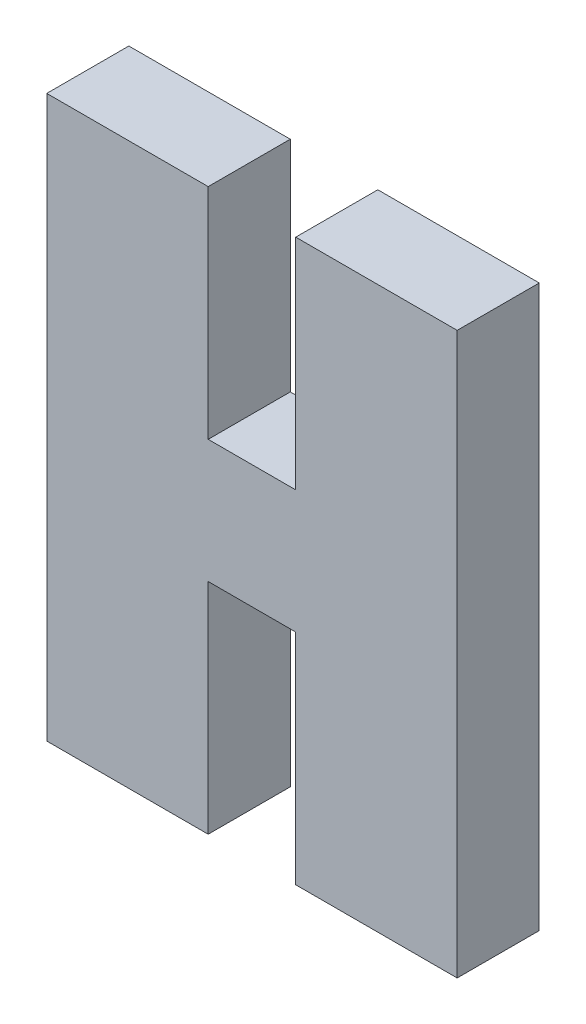
ISO-10303-21;
HEADER;
FILE_DESCRIPTION(('STEP AP214'),'2;1');
FILE_NAME('part.step','',(''),(''),'','','');
FILE_SCHEMA(('AUTOMOTIVE_DESIGN { 1 0 10303 214 1 1 1 1 }'));
ENDSEC;
DATA;
#1=APPLICATION_CONTEXT('core data for automotive mechanical design processes');
#2=APPLICATION_PROTOCOL_DEFINITION('international standard','automotive_design',2000,#1);
#3=PRODUCT_CONTEXT('',#1,'mechanical');
#4=PRODUCT('Part','Part','',(#3));
#5=PRODUCT_RELATED_PRODUCT_CATEGORY('part','',(#4));
#6=PRODUCT_DEFINITION_FORMATION('','',#4);
#7=PRODUCT_DEFINITION_CONTEXT('part definition',#1,'design');
#8=PRODUCT_DEFINITION('design','',#6,#7);
#9=PRODUCT_DEFINITION_SHAPE('','',#8);
#10=(LENGTH_UNIT() NAMED_UNIT(*) SI_UNIT(.MILLI.,.METRE.));
#11=(NAMED_UNIT(*) PLANE_ANGLE_UNIT() SI_UNIT($,.RADIAN.));
#12=(NAMED_UNIT(*) SI_UNIT($,.STERADIAN.) SOLID_ANGLE_UNIT());
#13=UNCERTAINTY_MEASURE_WITH_UNIT(LENGTH_MEASURE(1.E-05),#10,'distance_accuracy_value','');
#14=(GEOMETRIC_REPRESENTATION_CONTEXT(3) GLOBAL_UNCERTAINTY_ASSIGNED_CONTEXT((#13)) GLOBAL_UNIT_ASSIGNED_CONTEXT((#10,
#11,#12)) REPRESENTATION_CONTEXT('',''));
#15=CARTESIAN_POINT('',(0.,0.,0.));
#16=DIRECTION('',(0.,0.,1.));
#17=DIRECTION('',(1.,0.,0.));
#18=AXIS2_PLACEMENT_3D('',#15,#16,#17);
#19=CARTESIAN_POINT('',(-7.5,0.,3.));
#20=DIRECTION('',(-1.,0.,0.));
#21=DIRECTION('',(0.,0.,1.));
#22=AXIS2_PLACEMENT_3D('',#19,#20,#21);
#23=PLANE('',#22);
#24=DIRECTION('',(0.,1.,0.));
#25=VECTOR('',#24,1.);
#26=CARTESIAN_POINT('',(-7.5,0.,0.));
#27=LINE('',#26,#25);
#28=CARTESIAN_POINT('',(-7.5,-10.25,0.));
#29=VERTEX_POINT('',#28);
#30=CARTESIAN_POINT('',(-7.5,10.25,0.));
#31=VERTEX_POINT('',#30);
#32=EDGE_CURVE('E168',#29,#31,#27,.T.);
#33=ORIENTED_EDGE('',*,*,#32,.F.);
#34=DIRECTION('',(0.,0.,-1.));
#35=VECTOR('',#34,1.);
#36=CARTESIAN_POINT('',(-7.5,-10.25,3.));
#37=LINE('',#36,#35);
#38=CARTESIAN_POINT('',(-7.5,-10.25,3.));
#39=VERTEX_POINT('',#38);
#40=EDGE_CURVE('E11',#39,#29,#37,.T.);
#41=ORIENTED_EDGE('',*,*,#40,.F.);
#42=DIRECTION('',(0.,1.,0.));
#43=VECTOR('',#42,1.);
#44=CARTESIAN_POINT('',(-7.5,0.,3.));
#45=LINE('',#44,#43);
#46=CARTESIAN_POINT('',(-7.5,10.25,3.));
#47=VERTEX_POINT('',#46);
#48=EDGE_CURVE('E211',#39,#47,#45,.T.);
#49=ORIENTED_EDGE('',*,*,#48,.T.);
#50=DIRECTION('',(0.,0.,-1.));
#51=VECTOR('',#50,1.);
#52=CARTESIAN_POINT('',(-7.5,10.25,3.));
#53=LINE('',#52,#51);
#54=EDGE_CURVE('E60',#47,#31,#53,.T.);
#55=ORIENTED_EDGE('',*,*,#54,.T.);
#56=EDGE_LOOP('',(#33,#41,#49,#55));
#57=FACE_BOUND('',#56,.T.);
#58=ADVANCED_FACE('F43',(#57),#23,.T.);
#59=CARTESIAN_POINT('',(0.,-10.25,3.));
#60=DIRECTION('',(0.,1.,0.));
#61=DIRECTION('',(-1.,0.,0.));
#62=AXIS2_PLACEMENT_3D('',#59,#60,#61);
#63=PLANE('',#62);
#64=DIRECTION('',(1.,0.,0.));
#65=VECTOR('',#64,1.);
#66=CARTESIAN_POINT('',(0.,-10.25,0.));
#67=LINE('',#66,#65);
#68=CARTESIAN_POINT('',(-1.6,-10.25,0.));
#69=VERTEX_POINT('',#68);
#70=EDGE_CURVE('E171',#29,#69,#67,.T.);
#71=ORIENTED_EDGE('',*,*,#70,.T.);
#72=DIRECTION('',(0.,0.,-1.));
#73=VECTOR('',#72,1.);
#74=CARTESIAN_POINT('',(-1.6,-10.25,3.));
#75=LINE('',#74,#73);
#76=CARTESIAN_POINT('',(-1.6,-10.25,3.));
#77=VERTEX_POINT('',#76);
#78=EDGE_CURVE('E52',#77,#69,#75,.T.);
#79=ORIENTED_EDGE('',*,*,#78,.F.);
#80=DIRECTION('',(1.,0.,0.));
#81=VECTOR('',#80,1.);
#82=CARTESIAN_POINT('',(0.,-10.25,3.));
#83=LINE('',#82,#81);
#84=EDGE_CURVE('E480',#39,#77,#83,.T.);
#85=ORIENTED_EDGE('',*,*,#84,.F.);
#86=ORIENTED_EDGE('',*,*,#40,.T.);
#87=EDGE_LOOP('',(#71,#79,#85,#86));
#88=FACE_BOUND('',#87,.T.);
#89=ADVANCED_FACE('F246',(#88),#63,.F.);
#90=CARTESIAN_POINT('',(-1.6,0.,3.));
#91=DIRECTION('',(1.,0.,0.));
#92=DIRECTION('',(0.,1.,0.));
#93=AXIS2_PLACEMENT_3D('',#90,#91,#92);
#94=PLANE('',#93);
#95=DIRECTION('',(0.,-1.,0.));
#96=VECTOR('',#95,1.);
#97=CARTESIAN_POINT('',(-1.6,0.,0.));
#98=LINE('',#97,#96);
#99=CARTESIAN_POINT('',(-1.6,-2.25,0.));
#100=VERTEX_POINT('',#99);
#101=EDGE_CURVE('E175',#100,#69,#98,.T.);
#102=ORIENTED_EDGE('',*,*,#101,.F.);
#103=DIRECTION('',(0.,0.,-1.));
#104=VECTOR('',#103,1.);
#105=CARTESIAN_POINT('',(-1.6,-2.25,3.));
#106=LINE('',#105,#104);
#107=CARTESIAN_POINT('',(-1.6,-2.25,3.));
#108=VERTEX_POINT('',#107);
#109=EDGE_CURVE('E234',#108,#100,#106,.T.);
#110=ORIENTED_EDGE('',*,*,#109,.F.);
#111=DIRECTION('',(0.,-1.,0.));
#112=VECTOR('',#111,1.);
#113=CARTESIAN_POINT('',(-1.6,0.,3.));
#114=LINE('',#113,#112);
#115=EDGE_CURVE('E243',#108,#77,#114,.T.);
#116=ORIENTED_EDGE('',*,*,#115,.T.);
#117=ORIENTED_EDGE('',*,*,#78,.T.);
#118=EDGE_LOOP('',(#102,#110,#116,#117));
#119=FACE_BOUND('',#118,.T.);
#120=ADVANCED_FACE('F241',(#119),#94,.T.);
#121=CARTESIAN_POINT('',(0.,-2.25,3.));
#122=DIRECTION('',(0.,1.,0.));
#123=DIRECTION('',(-1.,0.,0.));
#124=AXIS2_PLACEMENT_3D('',#121,#122,#123);
#125=PLANE('',#124);
#126=DIRECTION('',(1.,0.,0.));
#127=VECTOR('',#126,1.);
#128=CARTESIAN_POINT('',(0.,-2.25,0.));
#129=LINE('',#128,#127);
#130=CARTESIAN_POINT('',(1.6,-2.25,0.));
#131=VERTEX_POINT('',#130);
#132=EDGE_CURVE('E179',#100,#131,#129,.T.);
#133=ORIENTED_EDGE('',*,*,#132,.T.);
#134=DIRECTION('',(0.,0.,-1.));
#135=VECTOR('',#134,1.);
#136=CARTESIAN_POINT('',(1.6,-2.25,3.));
#137=LINE('',#136,#135);
#138=CARTESIAN_POINT('',(1.6,-2.25,3.));
#139=VERTEX_POINT('',#138);
#140=EDGE_CURVE('E230',#139,#131,#137,.T.);
#141=ORIENTED_EDGE('',*,*,#140,.F.);
#142=DIRECTION('',(1.,0.,0.));
#143=VECTOR('',#142,1.);
#144=CARTESIAN_POINT('',(0.,-2.25,3.));
#145=LINE('',#144,#143);
#146=EDGE_CURVE('E264',#108,#139,#145,.T.);
#147=ORIENTED_EDGE('',*,*,#146,.F.);
#148=ORIENTED_EDGE('',*,*,#109,.T.);
#149=EDGE_LOOP('',(#133,#141,#147,#148));
#150=FACE_BOUND('',#149,.T.);
#151=ADVANCED_FACE('F253',(#150),#125,.F.);
#152=CARTESIAN_POINT('',(1.6,0.,3.));
#153=DIRECTION('',(1.,0.,0.));
#154=DIRECTION('',(0.,1.,0.));
#155=AXIS2_PLACEMENT_3D('',#152,#153,#154);
#156=PLANE('',#155);
#157=DIRECTION('',(0.,-1.,0.));
#158=VECTOR('',#157,1.);
#159=CARTESIAN_POINT('',(1.6,0.,0.));
#160=LINE('',#159,#158);
#161=CARTESIAN_POINT('',(1.6,-10.25,0.));
#162=VERTEX_POINT('',#161);
#163=EDGE_CURVE('E182',#131,#162,#160,.T.);
#164=ORIENTED_EDGE('',*,*,#163,.T.);
#165=DIRECTION('',(0.,0.,-1.));
#166=VECTOR('',#165,1.);
#167=CARTESIAN_POINT('',(1.6,-10.25,3.));
#168=LINE('',#167,#166);
#169=CARTESIAN_POINT('',(1.6,-10.25,3.));
#170=VERTEX_POINT('',#169);
#171=EDGE_CURVE('E227',#170,#162,#168,.T.);
#172=ORIENTED_EDGE('',*,*,#171,.F.);
#173=DIRECTION('',(0.,-1.,0.));
#174=VECTOR('',#173,1.);
#175=CARTESIAN_POINT('',(1.6,0.,3.));
#176=LINE('',#175,#174);
#177=EDGE_CURVE('E259',#139,#170,#176,.T.);
#178=ORIENTED_EDGE('',*,*,#177,.F.);
#179=ORIENTED_EDGE('',*,*,#140,.T.);
#180=EDGE_LOOP('',(#164,#172,#178,#179));
#181=FACE_BOUND('',#180,.T.);
#182=ADVANCED_FACE('F257',(#181),#156,.F.);
#183=CARTESIAN_POINT('',(0.,-10.25,3.));
#184=DIRECTION('',(0.,-1.,0.));
#185=DIRECTION('',(1.,0.,0.));
#186=AXIS2_PLACEMENT_3D('',#183,#184,#185);
#187=PLANE('',#186);
#188=DIRECTION('',(-1.,0.,0.));
#189=VECTOR('',#188,1.);
#190=CARTESIAN_POINT('',(0.,-10.25,0.));
#191=LINE('',#190,#189);
#192=CARTESIAN_POINT('',(7.5,-10.25,0.));
#193=VERTEX_POINT('',#192);
#194=EDGE_CURVE('E186',#193,#162,#191,.T.);
#195=ORIENTED_EDGE('',*,*,#194,.F.);
#196=DIRECTION('',(0.,0.,-1.));
#197=VECTOR('',#196,1.);
#198=CARTESIAN_POINT('',(7.5,-10.25,3.));
#199=LINE('',#198,#197);
#200=CARTESIAN_POINT('',(7.5,-10.25,3.));
#201=VERTEX_POINT('',#200);
#202=EDGE_CURVE('E224',#201,#193,#199,.T.);
#203=ORIENTED_EDGE('',*,*,#202,.F.);
#204=DIRECTION('',(-1.,0.,0.));
#205=VECTOR('',#204,1.);
#206=CARTESIAN_POINT('',(0.,-10.25,3.));
#207=LINE('',#206,#205);
#208=EDGE_CURVE('E263',#201,#170,#207,.T.);
#209=ORIENTED_EDGE('',*,*,#208,.T.);
#210=ORIENTED_EDGE('',*,*,#171,.T.);
#211=EDGE_LOOP('',(#195,#203,#209,#210));
#212=FACE_BOUND('',#211,.T.);
#213=ADVANCED_FACE('F308',(#212),#187,.T.);
#214=CARTESIAN_POINT('',(7.5,0.,3.));
#215=DIRECTION('',(1.,0.,0.));
#216=DIRECTION('',(0.,1.,0.));
#217=AXIS2_PLACEMENT_3D('',#214,#215,#216);
#218=PLANE('',#217);
#219=DIRECTION('',(0.,-1.,0.));
#220=VECTOR('',#219,1.);
#221=CARTESIAN_POINT('',(7.5,0.,0.));
#222=LINE('',#221,#220);
#223=CARTESIAN_POINT('',(7.5,10.25,0.));
#224=VERTEX_POINT('',#223);
#225=EDGE_CURVE('E190',#224,#193,#222,.T.);
#226=ORIENTED_EDGE('',*,*,#225,.F.);
#227=DIRECTION('',(0.,0.,-1.));
#228=VECTOR('',#227,1.);
#229=CARTESIAN_POINT('',(7.5,10.25,3.));
#230=LINE('',#229,#228);
#231=CARTESIAN_POINT('',(7.5,10.25,3.));
#232=VERTEX_POINT('',#231);
#233=EDGE_CURVE('E221',#232,#224,#230,.T.);
#234=ORIENTED_EDGE('',*,*,#233,.F.);
#235=DIRECTION('',(0.,-1.,0.));
#236=VECTOR('',#235,1.);
#237=CARTESIAN_POINT('',(7.5,0.,3.));
#238=LINE('',#237,#236);
#239=EDGE_CURVE('E268',#232,#201,#238,.T.);
#240=ORIENTED_EDGE('',*,*,#239,.T.);
#241=ORIENTED_EDGE('',*,*,#202,.T.);
#242=EDGE_LOOP('',(#226,#234,#240,#241));
#243=FACE_BOUND('',#242,.T.);
#244=ADVANCED_FACE('F311',(#243),#218,.T.);
#245=CARTESIAN_POINT('',(0.,10.25,3.));
#246=DIRECTION('',(0.,-1.,0.));
#247=DIRECTION('',(1.,0.,0.));
#248=AXIS2_PLACEMENT_3D('',#245,#246,#247);
#249=PLANE('',#248);
#250=DIRECTION('',(-1.,0.,0.));
#251=VECTOR('',#250,1.);
#252=CARTESIAN_POINT('',(0.,10.25,0.));
#253=LINE('',#252,#251);
#254=CARTESIAN_POINT('',(1.6,10.25,0.));
#255=VERTEX_POINT('',#254);
#256=EDGE_CURVE('E194',#224,#255,#253,.T.);
#257=ORIENTED_EDGE('',*,*,#256,.T.);
#258=DIRECTION('',(0.,0.,-1.));
#259=VECTOR('',#258,1.);
#260=CARTESIAN_POINT('',(1.6,10.25,3.));
#261=LINE('',#260,#259);
#262=CARTESIAN_POINT('',(1.6,10.25,3.));
#263=VERTEX_POINT('',#262);
#264=EDGE_CURVE('E218',#263,#255,#261,.T.);
#265=ORIENTED_EDGE('',*,*,#264,.F.);
#266=DIRECTION('',(-1.,0.,0.));
#267=VECTOR('',#266,1.);
#268=CARTESIAN_POINT('',(0.,10.25,3.));
#269=LINE('',#268,#267);
#270=EDGE_CURVE('E162',#232,#263,#269,.T.);
#271=ORIENTED_EDGE('',*,*,#270,.F.);
#272=ORIENTED_EDGE('',*,*,#233,.T.);
#273=EDGE_LOOP('',(#257,#265,#271,#272));
#274=FACE_BOUND('',#273,.T.);
#275=ADVANCED_FACE('F280',(#274),#249,.F.);
#276=CARTESIAN_POINT('',(1.6,0.,3.));
#277=DIRECTION('',(-1.,0.,0.));
#278=DIRECTION('',(0.,-1.,0.));
#279=AXIS2_PLACEMENT_3D('',#276,#277,#278);
#280=PLANE('',#279);
#281=DIRECTION('',(0.,1.,0.));
#282=VECTOR('',#281,1.);
#283=CARTESIAN_POINT('',(1.6,0.,0.));
#284=LINE('',#283,#282);
#285=CARTESIAN_POINT('',(1.6,2.25,0.));
#286=VERTEX_POINT('',#285);
#287=EDGE_CURVE('E198',#286,#255,#284,.T.);
#288=ORIENTED_EDGE('',*,*,#287,.F.);
#289=DIRECTION('',(0.,0.,-1.));
#290=VECTOR('',#289,1.);
#291=CARTESIAN_POINT('',(1.6,2.25,3.));
#292=LINE('',#291,#290);
#293=CARTESIAN_POINT('',(1.6,2.25,3.));
#294=VERTEX_POINT('',#293);
#295=EDGE_CURVE('E145',#294,#286,#292,.T.);
#296=ORIENTED_EDGE('',*,*,#295,.F.);
#297=DIRECTION('',(0.,1.,0.));
#298=VECTOR('',#297,1.);
#299=CARTESIAN_POINT('',(1.6,0.,3.));
#300=LINE('',#299,#298);
#301=EDGE_CURVE('E158',#294,#263,#300,.T.);
#302=ORIENTED_EDGE('',*,*,#301,.T.);
#303=ORIENTED_EDGE('',*,*,#264,.T.);
#304=EDGE_LOOP('',(#288,#296,#302,#303));
#305=FACE_BOUND('',#304,.T.);
#306=ADVANCED_FACE('F284',(#305),#280,.T.);
#307=CARTESIAN_POINT('',(0.,2.25,3.));
#308=DIRECTION('',(0.,1.,0.));
#309=DIRECTION('',(-1.,0.,0.));
#310=AXIS2_PLACEMENT_3D('',#307,#308,#309);
#311=PLANE('',#310);
#312=DIRECTION('',(1.,0.,0.));
#313=VECTOR('',#312,1.);
#314=CARTESIAN_POINT('',(0.,2.25,0.));
#315=LINE('',#314,#313);
#316=CARTESIAN_POINT('',(-1.6,2.25,0.));
#317=VERTEX_POINT('',#316);
#318=EDGE_CURVE('E141',#317,#286,#315,.T.);
#319=ORIENTED_EDGE('',*,*,#318,.F.);
#320=DIRECTION('',(0.,0.,-1.));
#321=VECTOR('',#320,1.);
#322=CARTESIAN_POINT('',(-1.6,2.25,3.));
#323=LINE('',#322,#321);
#324=CARTESIAN_POINT('',(-1.6,2.25,3.));
#325=VERTEX_POINT('',#324);
#326=EDGE_CURVE('E135',#325,#317,#323,.T.);
#327=ORIENTED_EDGE('',*,*,#326,.F.);
#328=DIRECTION('',(1.,0.,0.));
#329=VECTOR('',#328,1.);
#330=CARTESIAN_POINT('',(0.,2.25,3.));
#331=LINE('',#330,#329);
#332=EDGE_CURVE('E139',#325,#294,#331,.T.);
#333=ORIENTED_EDGE('',*,*,#332,.T.);
#334=ORIENTED_EDGE('',*,*,#295,.T.);
#335=EDGE_LOOP('',(#319,#327,#333,#334));
#336=FACE_BOUND('',#335,.T.);
#337=ADVANCED_FACE('F137',(#336),#311,.T.);
#338=CARTESIAN_POINT('',(-1.6,0.,3.));
#339=DIRECTION('',(-1.,0.,0.));
#340=DIRECTION('',(0.,0.,1.));
#341=AXIS2_PLACEMENT_3D('',#338,#339,#340);
#342=PLANE('',#341);
#343=DIRECTION('',(0.,1.,0.));
#344=VECTOR('',#343,1.);
#345=CARTESIAN_POINT('',(-1.6,0.,0.));
#346=LINE('',#345,#344);
#347=CARTESIAN_POINT('',(-1.6,10.25,0.));
#348=VERTEX_POINT('',#347);
#349=EDGE_CURVE('E204',#317,#348,#346,.T.);
#350=ORIENTED_EDGE('',*,*,#349,.T.);
#351=DIRECTION('',(0.,0.,-1.));
#352=VECTOR('',#351,1.);
#353=CARTESIAN_POINT('',(-1.6,10.25,3.));
#354=LINE('',#353,#352);
#355=CARTESIAN_POINT('',(-1.6,10.25,3.));
#356=VERTEX_POINT('',#355);
#357=EDGE_CURVE('E98',#356,#348,#354,.T.);
#358=ORIENTED_EDGE('',*,*,#357,.F.);
#359=DIRECTION('',(0.,1.,0.));
#360=VECTOR('',#359,1.);
#361=CARTESIAN_POINT('',(-1.6,0.,3.));
#362=LINE('',#361,#360);
#363=EDGE_CURVE('E147',#325,#356,#362,.T.);
#364=ORIENTED_EDGE('',*,*,#363,.F.);
#365=ORIENTED_EDGE('',*,*,#326,.T.);
#366=EDGE_LOOP('',(#350,#358,#364,#365));
#367=FACE_BOUND('',#366,.T.);
#368=ADVANCED_FACE('F148',(#367),#342,.F.);
#369=CARTESIAN_POINT('',(0.,10.25,3.));
#370=DIRECTION('',(0.,1.,0.));
#371=DIRECTION('',(0.,0.,1.));
#372=AXIS2_PLACEMENT_3D('',#369,#370,#371);
#373=PLANE('',#372);
#374=DIRECTION('',(1.,0.,0.));
#375=VECTOR('',#374,1.);
#376=CARTESIAN_POINT('',(0.,10.25,0.));
#377=LINE('',#376,#375);
#378=EDGE_CURVE('E207',#31,#348,#377,.T.);
#379=ORIENTED_EDGE('',*,*,#378,.F.);
#380=ORIENTED_EDGE('',*,*,#54,.F.);
#381=DIRECTION('',(1.,0.,0.));
#382=VECTOR('',#381,1.);
#383=CARTESIAN_POINT('',(0.,10.25,3.));
#384=LINE('',#383,#382);
#385=EDGE_CURVE('E152',#47,#356,#384,.T.);
#386=ORIENTED_EDGE('',*,*,#385,.T.);
#387=ORIENTED_EDGE('',*,*,#357,.T.);
#388=EDGE_LOOP('',(#379,#380,#386,#387));
#389=FACE_BOUND('',#388,.T.);
#390=ADVANCED_FACE('F285',(#389),#373,.T.);
#391=CARTESIAN_POINT('',(0.,0.,3.));
#392=DIRECTION('',(0.,0.,1.));
#393=DIRECTION('',(1.,0.,0.));
#394=AXIS2_PLACEMENT_3D('',#391,#392,#393);
#395=PLANE('',#394);
#396=ORIENTED_EDGE('',*,*,#48,.F.);
#397=ORIENTED_EDGE('',*,*,#84,.T.);
#398=ORIENTED_EDGE('',*,*,#115,.F.);
#399=ORIENTED_EDGE('',*,*,#146,.T.);
#400=ORIENTED_EDGE('',*,*,#177,.T.);
#401=ORIENTED_EDGE('',*,*,#208,.F.);
#402=ORIENTED_EDGE('',*,*,#239,.F.);
#403=ORIENTED_EDGE('',*,*,#270,.T.);
#404=ORIENTED_EDGE('',*,*,#301,.F.);
#405=ORIENTED_EDGE('',*,*,#332,.F.);
#406=ORIENTED_EDGE('',*,*,#363,.T.);
#407=ORIENTED_EDGE('',*,*,#385,.F.);
#408=EDGE_LOOP('',(#396,#397,#398,#399,#400,#401,#402,#403,#404,#405,#406,#407));
#409=FACE_BOUND('',#408,.T.);
#410=ADVANCED_FACE('F156',(#409),#395,.T.);
#411=CARTESIAN_POINT('',(0.,0.,0.));
#412=DIRECTION('',(0.,0.,1.));
#413=DIRECTION('',(1.,0.,0.));
#414=AXIS2_PLACEMENT_3D('',#411,#412,#413);
#415=PLANE('',#414);
#416=ORIENTED_EDGE('',*,*,#32,.T.);
#417=ORIENTED_EDGE('',*,*,#378,.T.);
#418=ORIENTED_EDGE('',*,*,#349,.F.);
#419=ORIENTED_EDGE('',*,*,#318,.T.);
#420=ORIENTED_EDGE('',*,*,#287,.T.);
#421=ORIENTED_EDGE('',*,*,#256,.F.);
#422=ORIENTED_EDGE('',*,*,#225,.T.);
#423=ORIENTED_EDGE('',*,*,#194,.T.);
#424=ORIENTED_EDGE('',*,*,#163,.F.);
#425=ORIENTED_EDGE('',*,*,#132,.F.);
#426=ORIENTED_EDGE('',*,*,#101,.T.);
#427=ORIENTED_EDGE('',*,*,#70,.F.);
#428=EDGE_LOOP('',(#416,#417,#418,#419,#420,#421,#422,#423,#424,#425,#426,#427));
#429=FACE_BOUND('',#428,.T.);
#430=ADVANCED_FACE('F249',(#429),#415,.F.);
#431=CLOSED_SHELL('',(#58,#89,#120,#151,#182,#213,#244,#275,#306,#337,#368,#390,#410,#430));
#432=MANIFOLD_SOLID_BREP('B2',#431);
#433=ADVANCED_BREP_SHAPE_REPRESENTATION('',(#18,#432),#14);
#434=SHAPE_DEFINITION_REPRESENTATION(#9,#433);
ENDSEC;
END-ISO-10303-21;
